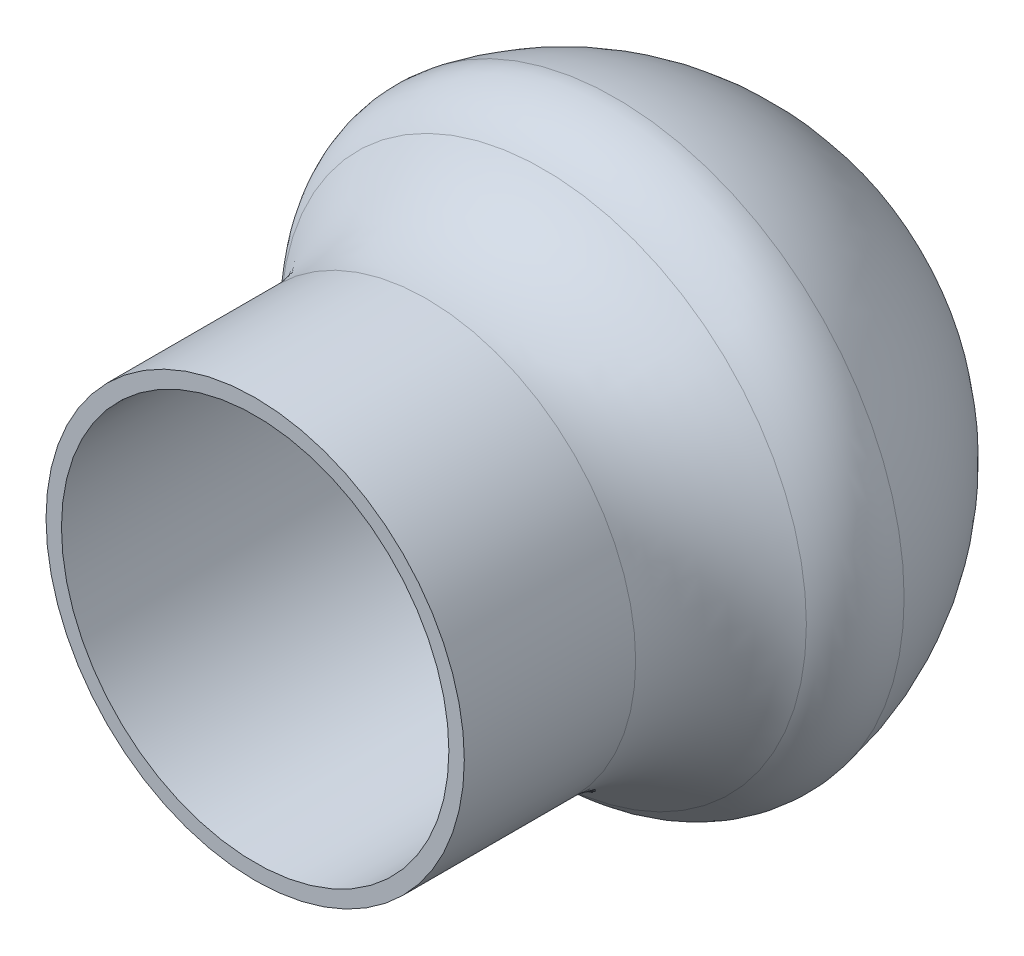
ISO-10303-21;
HEADER;
FILE_DESCRIPTION(('STEP AP214'),'2;1');
FILE_NAME('part.step','',(''),(''),'','','');
FILE_SCHEMA(('AUTOMOTIVE_DESIGN { 1 0 10303 214 1 1 1 1 }'));
ENDSEC;
DATA;
#1=APPLICATION_CONTEXT('core data for automotive mechanical design processes');
#2=APPLICATION_PROTOCOL_DEFINITION('international standard','automotive_design',2000,#1);
#3=PRODUCT_CONTEXT('',#1,'mechanical');
#4=PRODUCT('Part','Part','',(#3));
#5=PRODUCT_RELATED_PRODUCT_CATEGORY('part','',(#4));
#6=PRODUCT_DEFINITION_FORMATION('','',#4);
#7=PRODUCT_DEFINITION_CONTEXT('part definition',#1,'design');
#8=PRODUCT_DEFINITION('design','',#6,#7);
#9=PRODUCT_DEFINITION_SHAPE('','',#8);
#10=(LENGTH_UNIT() NAMED_UNIT(*) SI_UNIT(.MILLI.,.METRE.));
#11=(NAMED_UNIT(*) PLANE_ANGLE_UNIT() SI_UNIT($,.RADIAN.));
#12=(NAMED_UNIT(*) SI_UNIT($,.STERADIAN.) SOLID_ANGLE_UNIT());
#13=UNCERTAINTY_MEASURE_WITH_UNIT(LENGTH_MEASURE(1.E-05),#10,'distance_accuracy_value','');
#14=(GEOMETRIC_REPRESENTATION_CONTEXT(3) GLOBAL_UNCERTAINTY_ASSIGNED_CONTEXT((#13)) GLOBAL_UNIT_ASSIGNED_CONTEXT((#10,
#11,#12)) REPRESENTATION_CONTEXT('',''));
#15=CARTESIAN_POINT('',(0.,0.,0.));
#16=DIRECTION('',(0.,0.,1.));
#17=DIRECTION('',(1.,0.,0.));
#18=AXIS2_PLACEMENT_3D('',#15,#16,#17);
#19=CARTESIAN_POINT('',(0.,0.,20.));
#20=DIRECTION('',(0.,0.,1.));
#21=DIRECTION('',(1.,0.,0.));
#22=AXIS2_PLACEMENT_3D('',#19,#20,#21);
#23=PLANE('',#22);
#24=CARTESIAN_POINT('',(0.,0.,20.));
#25=DIRECTION('',(0.,0.,1.));
#26=DIRECTION('',(1.,0.,0.));
#27=AXIS2_PLACEMENT_3D('',#24,#25,#26);
#28=CIRCLE('',#27,13.55);
#29=CARTESIAN_POINT('',(13.55,0.,20.));
#30=VERTEX_POINT('',#29);
#31=EDGE_CURVE('E48',#30,#30,#28,.T.);
#32=ORIENTED_EDGE('',*,*,#31,.T.);
#33=EDGE_LOOP('',(#32));
#34=FACE_BOUND('',#33,.T.);
#35=CARTESIAN_POINT('',(0.,0.,20.));
#36=DIRECTION('',(0.,0.,1.));
#37=DIRECTION('',(1.,0.,0.));
#38=AXIS2_PLACEMENT_3D('',#35,#36,#37);
#39=CIRCLE('',#38,12.55);
#40=CARTESIAN_POINT('',(12.55,0.,20.));
#41=VERTEX_POINT('',#40);
#42=EDGE_CURVE('E53',#41,#41,#39,.T.);
#43=ORIENTED_EDGE('',*,*,#42,.F.);
#44=EDGE_LOOP('',(#43));
#45=FACE_BOUND('',#44,.T.);
#46=ADVANCED_FACE('F33',(#34,#45),#23,.T.);
#47=CARTESIAN_POINT('',(0.,0.,20.));
#48=DIRECTION('',(0.,0.,-1.));
#49=DIRECTION('',(-1.,0.,0.));
#50=AXIS2_PLACEMENT_3D('',#47,#48,#49);
#51=CYLINDRICAL_SURFACE('',#50,13.55);
#52=CARTESIAN_POINT('',(0.,0.,8.8980005788286));
#53=DIRECTION('',(0.,0.,-1.));
#54=DIRECTION('',(-1.,0.,0.));
#55=AXIS2_PLACEMENT_3D('',#52,#53,#54);
#56=CIRCLE('',#55,13.55);
#57=CARTESIAN_POINT('',(-13.55,0.,8.8980005788286));
#58=VERTEX_POINT('',#57);
#59=EDGE_CURVE('E44',#58,#58,#56,.F.);
#60=ORIENTED_EDGE('',*,*,#59,.T.);
#61=EDGE_LOOP('',(#60));
#62=FACE_BOUND('',#61,.T.);
#63=ORIENTED_EDGE('',*,*,#31,.F.);
#64=EDGE_LOOP('',(#63));
#65=FACE_BOUND('',#64,.T.);
#66=ADVANCED_FACE('F64',(#62,#65),#51,.T.);
#67=CARTESIAN_POINT('',(0.,0.,20.));
#68=DIRECTION('',(0.,0.,-1.));
#69=DIRECTION('',(-1.,0.,0.));
#70=AXIS2_PLACEMENT_3D('',#67,#68,#69);
#71=CYLINDRICAL_SURFACE('',#70,12.55);
#72=ORIENTED_EDGE('',*,*,#42,.T.);
#73=EDGE_LOOP('',(#72));
#74=FACE_BOUND('',#73,.T.);
#75=CARTESIAN_POINT('',(0.,0.,0.));
#76=DIRECTION('',(0.,0.,1.));
#77=DIRECTION('',(1.,0.,0.));
#78=AXIS2_PLACEMENT_3D('',#75,#76,#77);
#79=CIRCLE('',#78,12.55);
#80=CARTESIAN_POINT('',(12.55,0.,0.));
#81=VERTEX_POINT('',#80);
#82=EDGE_CURVE('E54',#81,#81,#79,.T.);
#83=ORIENTED_EDGE('',*,*,#82,.F.);
#84=EDGE_LOOP('',(#83));
#85=FACE_BOUND('',#84,.T.);
#86=ADVANCED_FACE('F60',(#74,#85),#71,.F.);
#87=CARTESIAN_POINT('',(0.,0.,0.));
#88=DIRECTION('',(0.,0.,-1.));
#89=DIRECTION('',(-1.,0.,0.));
#90=AXIS2_PLACEMENT_3D('',#87,#88,#89);
#91=PLANE('',#90);
#92=ORIENTED_EDGE('',*,*,#82,.T.);
#93=EDGE_LOOP('',(#92));
#94=FACE_BOUND('',#93,.T.);
#95=ADVANCED_FACE('F82',(#94),#91,.F.);
#96=CARTESIAN_POINT('',(0.,0.,0.));
#97=DIRECTION('',(0.,0.,-1.));
#98=DIRECTION('',(0.,-1.,0.));
#99=AXIS2_PLACEMENT_3D('',#96,#97,#98);
#100=SPHERICAL_SURFACE('',#99,18.9864941438444);
#101=CARTESIAN_POINT('',(0.,0.,-3.35583668311213));
#102=DIRECTION('',(0.,0.,1.));
#103=DIRECTION('',(1.,0.,0.));
#104=AXIS2_PLACEMENT_3D('',#101,#102,#103);
#105=CIRCLE('',#104,18.6875712715836);
#106=CARTESIAN_POINT('',(18.6875712715836,0.,-3.35583668311213));
#107=VERTEX_POINT('',#106);
#108=EDGE_CURVE('E40',#107,#107,#105,.F.);
#109=ORIENTED_EDGE('',*,*,#108,.T.);
#110=EDGE_LOOP('',(#109));
#111=FACE_BOUND('',#110,.T.);
#112=ADVANCED_FACE('F76',(#111),#100,.T.);
#113=CARTESIAN_POINT('',(0.,0.,8.8980005788286));
#114=DIRECTION('',(0.,0.,-1.));
#115=DIRECTION('',(-1.,0.,0.));
#116=AXIS2_PLACEMENT_3D('',#113,#114,#115);
#117=TOROIDAL_SURFACE('',#116,23.55,10.);
#118=CARTESIAN_POINT('',(0.,0.,1.31793781202271));
#119=DIRECTION('',(0.,0.,1.));
#120=DIRECTION('',(1.,0.,0.));
#121=AXIS2_PLACEMENT_3D('',#118,#119,#120);
#122=CIRCLE('',#121,17.0275274280927);
#123=CARTESIAN_POINT('',(17.0275274280927,0.,1.31793781202271));
#124=VERTEX_POINT('',#123);
#125=EDGE_CURVE('E10',#124,#124,#122,.T.);
#126=ORIENTED_EDGE('',*,*,#125,.T.);
#127=EDGE_LOOP('',(#126));
#128=FACE_BOUND('',#127,.T.);
#129=ORIENTED_EDGE('',*,*,#59,.F.);
#130=EDGE_LOOP('',(#129));
#131=FACE_BOUND('',#130,.T.);
#132=ADVANCED_FACE('F74',(#128,#131),#117,.F.);
#133=CARTESIAN_POINT('',(0.,0.,-2.47209357138022));
#134=DIRECTION('',(0.,0.,-1.));
#135=DIRECTION('',(-1.,0.,0.));
#136=AXIS2_PLACEMENT_3D('',#133,#134,#135);
#137=TOROIDAL_SURFACE('',#136,13.766291142139,5.);
#138=ORIENTED_EDGE('',*,*,#125,.F.);
#139=EDGE_LOOP('',(#138));
#140=FACE_BOUND('',#139,.T.);
#141=ORIENTED_EDGE('',*,*,#108,.F.);
#142=EDGE_LOOP('',(#141));
#143=FACE_BOUND('',#142,.T.);
#144=ADVANCED_FACE('F35',(#140,#143),#137,.T.);
#145=CLOSED_SHELL('',(#46,#66,#86,#95,#112,#132,#144));
#146=MANIFOLD_SOLID_BREP('B2',#145);
#147=ADVANCED_BREP_SHAPE_REPRESENTATION('',(#18,#146),#14);
#148=SHAPE_DEFINITION_REPRESENTATION(#9,#147);
ENDSEC;
END-ISO-10303-21;
